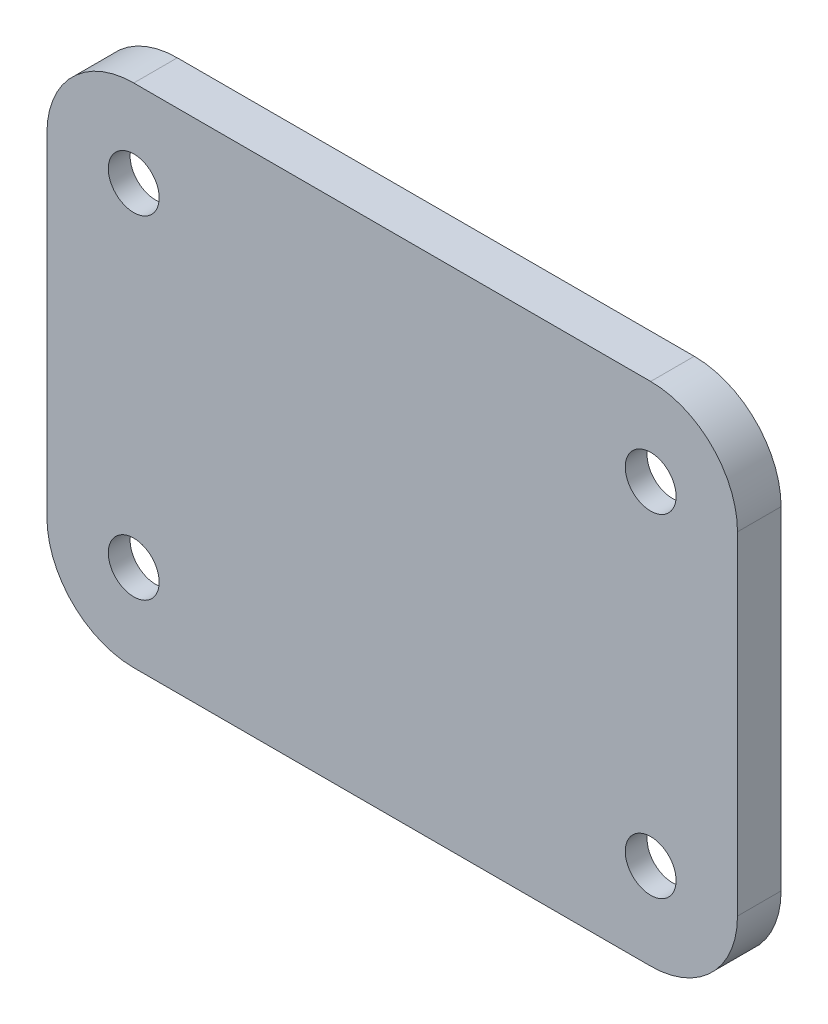
ISO-10303-21;
HEADER;
FILE_DESCRIPTION(('STEP AP214'),'2;1');
FILE_NAME('part.step','',(''),(''),'','','');
FILE_SCHEMA(('AUTOMOTIVE_DESIGN { 1 0 10303 214 1 1 1 1 }'));
ENDSEC;
DATA;
#1=APPLICATION_CONTEXT('core data for automotive mechanical design processes');
#2=APPLICATION_PROTOCOL_DEFINITION('international standard','automotive_design',2000,#1);
#3=PRODUCT_CONTEXT('',#1,'mechanical');
#4=PRODUCT('Part','Part','',(#3));
#5=PRODUCT_RELATED_PRODUCT_CATEGORY('part','',(#4));
#6=PRODUCT_DEFINITION_FORMATION('','',#4);
#7=PRODUCT_DEFINITION_CONTEXT('part definition',#1,'design');
#8=PRODUCT_DEFINITION('design','',#6,#7);
#9=PRODUCT_DEFINITION_SHAPE('','',#8);
#10=(LENGTH_UNIT() NAMED_UNIT(*) SI_UNIT(.MILLI.,.METRE.));
#11=(NAMED_UNIT(*) PLANE_ANGLE_UNIT() SI_UNIT($,.RADIAN.));
#12=(NAMED_UNIT(*) SI_UNIT($,.STERADIAN.) SOLID_ANGLE_UNIT());
#13=UNCERTAINTY_MEASURE_WITH_UNIT(LENGTH_MEASURE(1.E-05),#10,'distance_accuracy_value','');
#14=(GEOMETRIC_REPRESENTATION_CONTEXT(3) GLOBAL_UNCERTAINTY_ASSIGNED_CONTEXT((#13)) GLOBAL_UNIT_ASSIGNED_CONTEXT((#10,
#11,#12)) REPRESENTATION_CONTEXT('',''));
#15=CARTESIAN_POINT('',(0.,0.,0.));
#16=DIRECTION('',(0.,0.,1.));
#17=DIRECTION('',(1.,0.,0.));
#18=AXIS2_PLACEMENT_3D('',#15,#16,#17);
#19=CARTESIAN_POINT('',(0.,0.,0.));
#20=DIRECTION('',(0.,0.,1.));
#21=DIRECTION('',(1.,0.,0.));
#22=AXIS2_PLACEMENT_3D('',#19,#20,#21);
#23=PLANE('',#22);
#24=CARTESIAN_POINT('',(-17.7875,-11.45,0.));
#25=DIRECTION('',(0.,0.,1.));
#26=DIRECTION('',(1.,0.,0.));
#27=AXIS2_PLACEMENT_3D('',#24,#25,#26);
#28=CIRCLE('',#27,1.75);
#29=CARTESIAN_POINT('',(-16.0375,-11.45,0.));
#30=VERTEX_POINT('',#29);
#31=EDGE_CURVE('E442',#30,#30,#28,.T.);
#32=ORIENTED_EDGE('',*,*,#31,.T.);
#33=EDGE_LOOP('',(#32));
#34=FACE_BOUND('',#33,.T.);
#35=DIRECTION('',(1.,0.,0.));
#36=VECTOR('',#35,1.);
#37=CARTESIAN_POINT('',(0.,-6.97500000000003,0.));
#38=LINE('',#37,#36);
#39=CARTESIAN_POINT('',(-22.2625,-6.97500000000003,0.));
#40=VERTEX_POINT('',#39);
#41=CARTESIAN_POINT('',(-17.7875,-6.97500000000003,0.));
#42=VERTEX_POINT('',#41);
#43=EDGE_CURVE('E50',#40,#42,#38,.T.);
#44=ORIENTED_EDGE('',*,*,#43,.T.);
#45=CARTESIAN_POINT('',(-17.7875,-11.45,0.));
#46=DIRECTION('',(0.,0.,-1.));
#47=DIRECTION('',(-1.,0.,0.));
#48=AXIS2_PLACEMENT_3D('',#45,#46,#47);
#49=CIRCLE('',#48,4.47499999999997);
#50=CARTESIAN_POINT('',(-13.3125,-11.45,0.));
#51=VERTEX_POINT('',#50);
#52=EDGE_CURVE('E308',#42,#51,#49,.T.);
#53=ORIENTED_EDGE('',*,*,#52,.T.);
#54=DIRECTION('',(0.,1.,0.));
#55=VECTOR('',#54,1.);
#56=CARTESIAN_POINT('',(-13.3125,0.,0.));
#57=LINE('',#56,#55);
#58=CARTESIAN_POINT('',(-13.3125,-15.925,0.));
#59=VERTEX_POINT('',#58);
#60=EDGE_CURVE('E305',#59,#51,#57,.T.);
#61=ORIENTED_EDGE('',*,*,#60,.F.);
#62=DIRECTION('',(-1.,0.,0.));
#63=VECTOR('',#62,1.);
#64=CARTESIAN_POINT('',(17.7875,-15.925,0.));
#65=LINE('',#64,#63);
#66=CARTESIAN_POINT('',(-17.7875,-15.925,0.));
#67=VERTEX_POINT('',#66);
#68=EDGE_CURVE('E385',#59,#67,#65,.T.);
#69=ORIENTED_EDGE('',*,*,#68,.T.);
#70=CARTESIAN_POINT('',(-17.7875,-11.45,0.));
#71=DIRECTION('',(0.,0.,-1.));
#72=DIRECTION('',(-1.,0.,0.));
#73=AXIS2_PLACEMENT_3D('',#70,#71,#72);
#74=CIRCLE('',#73,4.47499999999997);
#75=CARTESIAN_POINT('',(-22.2625,-11.45,0.));
#76=VERTEX_POINT('',#75);
#77=EDGE_CURVE('E389',#67,#76,#74,.T.);
#78=ORIENTED_EDGE('',*,*,#77,.T.);
#79=DIRECTION('',(0.,1.,0.));
#80=VECTOR('',#79,1.);
#81=CARTESIAN_POINT('',(-22.2625,-11.45,0.));
#82=LINE('',#81,#80);
#83=EDGE_CURVE('E354',#76,#40,#82,.T.);
#84=ORIENTED_EDGE('',*,*,#83,.T.);
#85=EDGE_LOOP('',(#44,#53,#61,#69,#78,#84));
#86=FACE_BOUND('',#85,.T.);
#87=ADVANCED_FACE('F35',(#34,#86),#23,.F.);
#88=CARTESIAN_POINT('',(17.7875,-11.45,0.));
#89=DIRECTION('',(0.,0.,1.));
#90=DIRECTION('',(1.,0.,0.));
#91=AXIS2_PLACEMENT_3D('',#88,#89,#90);
#92=CIRCLE('',#91,1.75);
#93=CARTESIAN_POINT('',(19.5375,-11.45,0.));
#94=VERTEX_POINT('',#93);
#95=EDGE_CURVE('E475',#94,#94,#92,.T.);
#96=ORIENTED_EDGE('',*,*,#95,.T.);
#97=EDGE_LOOP('',(#96));
#98=FACE_BOUND('',#97,.T.);
#99=DIRECTION('',(0.,1.,0.));
#100=VECTOR('',#99,1.);
#101=CARTESIAN_POINT('',(13.3125,0.,0.));
#102=LINE('',#101,#100);
#103=CARTESIAN_POINT('',(13.3125,-15.925,0.));
#104=VERTEX_POINT('',#103);
#105=CARTESIAN_POINT('',(13.3125,-6.97500000000003,0.));
#106=VERTEX_POINT('',#105);
#107=EDGE_CURVE('E302',#104,#106,#102,.T.);
#108=ORIENTED_EDGE('',*,*,#107,.T.);
#109=DIRECTION('',(1.,0.,0.));
#110=VECTOR('',#109,1.);
#111=CARTESIAN_POINT('',(0.,-6.97500000000003,0.));
#112=LINE('',#111,#110);
#113=CARTESIAN_POINT('',(22.2625,-6.97500000000003,0.));
#114=VERTEX_POINT('',#113);
#115=EDGE_CURVE('E299',#106,#114,#112,.T.);
#116=ORIENTED_EDGE('',*,*,#115,.T.);
#117=DIRECTION('',(0.,-1.,0.));
#118=VECTOR('',#117,1.);
#119=CARTESIAN_POINT('',(22.2625,11.45,0.));
#120=LINE('',#119,#118);
#121=CARTESIAN_POINT('',(22.2625,-11.45,0.));
#122=VERTEX_POINT('',#121);
#123=EDGE_CURVE('E378',#114,#122,#120,.T.);
#124=ORIENTED_EDGE('',*,*,#123,.T.);
#125=CARTESIAN_POINT('',(17.7875,-11.45,0.));
#126=DIRECTION('',(0.,0.,-1.));
#127=DIRECTION('',(-1.,0.,0.));
#128=AXIS2_PLACEMENT_3D('',#125,#126,#127);
#129=CIRCLE('',#128,4.47499999999998);
#130=CARTESIAN_POINT('',(17.7875,-15.925,0.));
#131=VERTEX_POINT('',#130);
#132=EDGE_CURVE('E382',#122,#131,#129,.T.);
#133=ORIENTED_EDGE('',*,*,#132,.T.);
#134=EDGE_CURVE('E386',#131,#104,#65,.T.);
#135=ORIENTED_EDGE('',*,*,#134,.T.);
#136=EDGE_LOOP('',(#108,#116,#124,#133,#135));
#137=FACE_BOUND('',#136,.T.);
#138=ADVANCED_FACE('F552',(#98,#137),#23,.F.);
#139=CARTESIAN_POINT('',(17.7875,11.45,0.));
#140=DIRECTION('',(0.,0.,1.));
#141=DIRECTION('',(1.,0.,0.));
#142=AXIS2_PLACEMENT_3D('',#139,#140,#141);
#143=CIRCLE('',#142,1.75);
#144=CARTESIAN_POINT('',(19.5375,11.45,0.));
#145=VERTEX_POINT('',#144);
#146=EDGE_CURVE('E472',#145,#145,#143,.T.);
#147=ORIENTED_EDGE('',*,*,#146,.T.);
#148=EDGE_LOOP('',(#147));
#149=FACE_BOUND('',#148,.T.);
#150=DIRECTION('',(0.,1.,0.));
#151=VECTOR('',#150,1.);
#152=CARTESIAN_POINT('',(13.3125,0.,0.));
#153=LINE('',#152,#151);
#154=CARTESIAN_POINT('',(13.3125,11.45,0.));
#155=VERTEX_POINT('',#154);
#156=CARTESIAN_POINT('',(13.3125,15.925,0.));
#157=VERTEX_POINT('',#156);
#158=EDGE_CURVE('E260',#155,#157,#153,.T.);
#159=ORIENTED_EDGE('',*,*,#158,.T.);
#160=DIRECTION('',(1.,0.,0.));
#161=VECTOR('',#160,1.);
#162=CARTESIAN_POINT('',(-17.7875,15.925,0.));
#163=LINE('',#162,#161);
#164=CARTESIAN_POINT('',(17.7875,15.925,0.));
#165=VERTEX_POINT('',#164);
#166=EDGE_CURVE('E371',#157,#165,#163,.T.);
#167=ORIENTED_EDGE('',*,*,#166,.T.);
#168=CARTESIAN_POINT('',(17.7875,11.45,0.));
#169=DIRECTION('',(0.,0.,-1.));
#170=DIRECTION('',(-1.,0.,0.));
#171=AXIS2_PLACEMENT_3D('',#168,#169,#170);
#172=CIRCLE('',#171,4.47499999999998);
#173=CARTESIAN_POINT('',(22.2625,11.45,0.));
#174=VERTEX_POINT('',#173);
#175=EDGE_CURVE('E375',#165,#174,#172,.T.);
#176=ORIENTED_EDGE('',*,*,#175,.T.);
#177=CARTESIAN_POINT('',(22.2625,6.97500000000003,0.));
#178=VERTEX_POINT('',#177);
#179=EDGE_CURVE('E379',#174,#178,#120,.T.);
#180=ORIENTED_EDGE('',*,*,#179,.T.);
#181=DIRECTION('',(1.,0.,0.));
#182=VECTOR('',#181,1.);
#183=CARTESIAN_POINT('',(0.,6.97500000000003,0.));
#184=LINE('',#183,#182);
#185=CARTESIAN_POINT('',(17.7875,6.97500000000003,0.));
#186=VERTEX_POINT('',#185);
#187=EDGE_CURVE('E297',#186,#178,#184,.T.);
#188=ORIENTED_EDGE('',*,*,#187,.F.);
#189=CARTESIAN_POINT('',(17.7875,11.45,0.));
#190=DIRECTION('',(0.,0.,-1.));
#191=DIRECTION('',(-1.,0.,0.));
#192=AXIS2_PLACEMENT_3D('',#189,#190,#191);
#193=CIRCLE('',#192,4.47499999999998);
#194=EDGE_CURVE('E246',#186,#155,#193,.T.);
#195=ORIENTED_EDGE('',*,*,#194,.T.);
#196=EDGE_LOOP('',(#159,#167,#176,#180,#188,#195));
#197=FACE_BOUND('',#196,.T.);
#198=ADVANCED_FACE('F658',(#149,#197),#23,.F.);
#199=CARTESIAN_POINT('',(0.,-17.425,1.5));
#200=DIRECTION('',(0.,-1.,0.));
#201=DIRECTION('',(0.,0.,-1.));
#202=AXIS2_PLACEMENT_3D('',#199,#200,#201);
#203=PLANE('',#202);
#204=DIRECTION('',(0.,0.,-1.));
#205=VECTOR('',#204,1.);
#206=CARTESIAN_POINT('',(-17.7875,-17.425,1.5));
#207=LINE('',#206,#205);
#208=CARTESIAN_POINT('',(-17.7875,-17.425,1.5));
#209=VERTEX_POINT('',#208);
#210=CARTESIAN_POINT('',(-17.7875,-17.425,-1.5));
#211=VERTEX_POINT('',#210);
#212=EDGE_CURVE('E469',#209,#211,#207,.T.);
#213=ORIENTED_EDGE('',*,*,#212,.T.);
#214=DIRECTION('',(-1.,0.,0.));
#215=VECTOR('',#214,1.);
#216=CARTESIAN_POINT('',(17.7875,-17.425,-1.5));
#217=LINE('',#216,#215);
#218=CARTESIAN_POINT('',(17.7875,-17.425,-1.5));
#219=VERTEX_POINT('',#218);
#220=EDGE_CURVE('E434',#219,#211,#217,.T.);
#221=ORIENTED_EDGE('',*,*,#220,.F.);
#222=DIRECTION('',(0.,0.,-1.));
#223=VECTOR('',#222,1.);
#224=CARTESIAN_POINT('',(17.7875,-17.425,1.5));
#225=LINE('',#224,#223);
#226=CARTESIAN_POINT('',(17.7875,-17.425,1.5));
#227=VERTEX_POINT('',#226);
#228=EDGE_CURVE('E11',#227,#219,#225,.T.);
#229=ORIENTED_EDGE('',*,*,#228,.F.);
#230=DIRECTION('',(-1.,0.,0.));
#231=VECTOR('',#230,1.);
#232=CARTESIAN_POINT('',(0.,-17.425,1.5));
#233=LINE('',#232,#231);
#234=EDGE_CURVE('E438',#227,#209,#233,.T.);
#235=ORIENTED_EDGE('',*,*,#234,.T.);
#236=EDGE_LOOP('',(#213,#221,#229,#235));
#237=FACE_BOUND('',#236,.T.);
#238=ADVANCED_FACE('F37',(#237),#203,.T.);
#239=CARTESIAN_POINT('',(17.7875,-11.45,1.5));
#240=DIRECTION('',(0.,0.,-1.));
#241=DIRECTION('',(-1.,0.,0.));
#242=AXIS2_PLACEMENT_3D('',#239,#240,#241);
#243=CYLINDRICAL_SURFACE('',#242,5.97499999999997);
#244=ORIENTED_EDGE('',*,*,#228,.T.);
#245=CARTESIAN_POINT('',(17.7875,-11.45,-1.5));
#246=DIRECTION('',(0.,0.,-1.));
#247=DIRECTION('',(-1.,0.,0.));
#248=AXIS2_PLACEMENT_3D('',#245,#246,#247);
#249=CIRCLE('',#248,5.97499999999997);
#250=CARTESIAN_POINT('',(23.7625,-11.45,-1.5));
#251=VERTEX_POINT('',#250);
#252=EDGE_CURVE('E431',#251,#219,#249,.T.);
#253=ORIENTED_EDGE('',*,*,#252,.F.);
#254=DIRECTION('',(0.,0.,-1.));
#255=VECTOR('',#254,1.);
#256=CARTESIAN_POINT('',(23.7625,-11.45,1.5));
#257=LINE('',#256,#255);
#258=CARTESIAN_POINT('',(23.7625,-11.45,1.5));
#259=VERTEX_POINT('',#258);
#260=EDGE_CURVE('E43',#259,#251,#257,.T.);
#261=ORIENTED_EDGE('',*,*,#260,.F.);
#262=CARTESIAN_POINT('',(17.7875,-11.45,1.5));
#263=DIRECTION('',(0.,0.,1.));
#264=DIRECTION('',(1.,0.,0.));
#265=AXIS2_PLACEMENT_3D('',#262,#263,#264);
#266=CIRCLE('',#265,5.97499999999997);
#267=EDGE_CURVE('E441',#227,#259,#266,.T.);
#268=ORIENTED_EDGE('',*,*,#267,.F.);
#269=EDGE_LOOP('',(#244,#253,#261,#268));
#270=FACE_BOUND('',#269,.T.);
#271=ADVANCED_FACE('F504',(#270),#243,.T.);
#272=CARTESIAN_POINT('',(23.7625,0.,1.5));
#273=DIRECTION('',(-1.,0.,0.));
#274=DIRECTION('',(0.,0.,1.));
#275=AXIS2_PLACEMENT_3D('',#272,#273,#274);
#276=PLANE('',#275);
#277=ORIENTED_EDGE('',*,*,#260,.T.);
#278=DIRECTION('',(0.,-1.,0.));
#279=VECTOR('',#278,1.);
#280=CARTESIAN_POINT('',(23.7625,11.45,-1.5));
#281=LINE('',#280,#279);
#282=CARTESIAN_POINT('',(23.7625,11.45,-1.5));
#283=VERTEX_POINT('',#282);
#284=EDGE_CURVE('E428',#283,#251,#281,.T.);
#285=ORIENTED_EDGE('',*,*,#284,.F.);
#286=DIRECTION('',(0.,0.,-1.));
#287=VECTOR('',#286,1.);
#288=CARTESIAN_POINT('',(23.7625,11.45,1.5));
#289=LINE('',#288,#287);
#290=CARTESIAN_POINT('',(23.7625,11.45,1.5));
#291=VERTEX_POINT('',#290);
#292=EDGE_CURVE('E489',#291,#283,#289,.T.);
#293=ORIENTED_EDGE('',*,*,#292,.F.);
#294=DIRECTION('',(0.,1.,0.));
#295=VECTOR('',#294,1.);
#296=CARTESIAN_POINT('',(23.7625,0.,1.5));
#297=LINE('',#296,#295);
#298=EDGE_CURVE('E444',#259,#291,#297,.T.);
#299=ORIENTED_EDGE('',*,*,#298,.F.);
#300=EDGE_LOOP('',(#277,#285,#293,#299));
#301=FACE_BOUND('',#300,.T.);
#302=ADVANCED_FACE('F494',(#301),#276,.F.);
#303=CARTESIAN_POINT('',(17.7875,11.45,1.5));
#304=DIRECTION('',(0.,0.,-1.));
#305=DIRECTION('',(-1.,0.,0.));
#306=AXIS2_PLACEMENT_3D('',#303,#304,#305);
#307=CYLINDRICAL_SURFACE('',#306,5.97499999999997);
#308=ORIENTED_EDGE('',*,*,#292,.T.);
#309=CARTESIAN_POINT('',(17.7875,11.45,-1.5));
#310=DIRECTION('',(0.,0.,-1.));
#311=DIRECTION('',(-1.,0.,0.));
#312=AXIS2_PLACEMENT_3D('',#309,#310,#311);
#313=CIRCLE('',#312,5.97499999999998);
#314=CARTESIAN_POINT('',(17.7875,17.425,-1.5));
#315=VERTEX_POINT('',#314);
#316=EDGE_CURVE('E425',#315,#283,#313,.T.);
#317=ORIENTED_EDGE('',*,*,#316,.F.);
#318=DIRECTION('',(0.,0.,-1.));
#319=VECTOR('',#318,1.);
#320=CARTESIAN_POINT('',(17.7875,17.425,1.5));
#321=LINE('',#320,#319);
#322=CARTESIAN_POINT('',(17.7875,17.425,1.5));
#323=VERTEX_POINT('',#322);
#324=EDGE_CURVE('E487',#323,#315,#321,.T.);
#325=ORIENTED_EDGE('',*,*,#324,.F.);
#326=CARTESIAN_POINT('',(17.7875,11.45,1.5));
#327=DIRECTION('',(0.,0.,1.));
#328=DIRECTION('',(1.,0.,0.));
#329=AXIS2_PLACEMENT_3D('',#326,#327,#328);
#330=CIRCLE('',#329,5.97499999999997);
#331=EDGE_CURVE('E446',#291,#323,#330,.T.);
#332=ORIENTED_EDGE('',*,*,#331,.F.);
#333=EDGE_LOOP('',(#308,#317,#325,#332));
#334=FACE_BOUND('',#333,.T.);
#335=ADVANCED_FACE('F528',(#334),#307,.T.);
#336=CARTESIAN_POINT('',(0.,17.425,1.5));
#337=DIRECTION('',(0.,-1.,0.));
#338=DIRECTION('',(0.,0.,-1.));
#339=AXIS2_PLACEMENT_3D('',#336,#337,#338);
#340=PLANE('',#339);
#341=ORIENTED_EDGE('',*,*,#324,.T.);
#342=DIRECTION('',(1.,0.,0.));
#343=VECTOR('',#342,1.);
#344=CARTESIAN_POINT('',(-17.7875,17.425,-1.5));
#345=LINE('',#344,#343);
#346=CARTESIAN_POINT('',(-17.7875,17.425,-1.5));
#347=VERTEX_POINT('',#346);
#348=EDGE_CURVE('E422',#347,#315,#345,.T.);
#349=ORIENTED_EDGE('',*,*,#348,.F.);
#350=DIRECTION('',(0.,0.,-1.));
#351=VECTOR('',#350,1.);
#352=CARTESIAN_POINT('',(-17.7875,17.425,1.5));
#353=LINE('',#352,#351);
#354=CARTESIAN_POINT('',(-17.7875,17.425,1.5));
#355=VERTEX_POINT('',#354);
#356=EDGE_CURVE('E485',#355,#347,#353,.T.);
#357=ORIENTED_EDGE('',*,*,#356,.F.);
#358=DIRECTION('',(-1.,0.,0.));
#359=VECTOR('',#358,1.);
#360=CARTESIAN_POINT('',(0.,17.425,1.5));
#361=LINE('',#360,#359);
#362=EDGE_CURVE('E448',#323,#355,#361,.T.);
#363=ORIENTED_EDGE('',*,*,#362,.F.);
#364=EDGE_LOOP('',(#341,#349,#357,#363));
#365=FACE_BOUND('',#364,.T.);
#366=ADVANCED_FACE('F525',(#365),#340,.F.);
#367=CARTESIAN_POINT('',(-17.7875,11.45,1.5));
#368=DIRECTION('',(0.,0.,-1.));
#369=DIRECTION('',(-1.,0.,0.));
#370=AXIS2_PLACEMENT_3D('',#367,#368,#369);
#371=CYLINDRICAL_SURFACE('',#370,5.97499999999997);
#372=ORIENTED_EDGE('',*,*,#356,.T.);
#373=CARTESIAN_POINT('',(-17.7875,11.45,-1.5));
#374=DIRECTION('',(0.,0.,-1.));
#375=DIRECTION('',(-1.,0.,0.));
#376=AXIS2_PLACEMENT_3D('',#373,#374,#375);
#377=CIRCLE('',#376,5.97499999999998);
#378=CARTESIAN_POINT('',(-23.7625,11.45,-1.5));
#379=VERTEX_POINT('',#378);
#380=EDGE_CURVE('E419',#379,#347,#377,.T.);
#381=ORIENTED_EDGE('',*,*,#380,.F.);
#382=DIRECTION('',(0.,0.,-1.));
#383=VECTOR('',#382,1.);
#384=CARTESIAN_POINT('',(-23.7625,11.45,1.5));
#385=LINE('',#384,#383);
#386=CARTESIAN_POINT('',(-23.7625,11.45,1.5));
#387=VERTEX_POINT('',#386);
#388=EDGE_CURVE('E483',#387,#379,#385,.T.);
#389=ORIENTED_EDGE('',*,*,#388,.F.);
#390=CARTESIAN_POINT('',(-17.7875,11.45,1.5));
#391=DIRECTION('',(0.,0.,1.));
#392=DIRECTION('',(1.,0.,0.));
#393=AXIS2_PLACEMENT_3D('',#390,#391,#392);
#394=CIRCLE('',#393,5.97499999999997);
#395=EDGE_CURVE('E450',#355,#387,#394,.T.);
#396=ORIENTED_EDGE('',*,*,#395,.F.);
#397=EDGE_LOOP('',(#372,#381,#389,#396));
#398=FACE_BOUND('',#397,.T.);
#399=ADVANCED_FACE('F520',(#398),#371,.T.);
#400=CARTESIAN_POINT('',(-23.7625,0.,1.5));
#401=DIRECTION('',(-1.,0.,0.));
#402=DIRECTION('',(0.,0.,1.));
#403=AXIS2_PLACEMENT_3D('',#400,#401,#402);
#404=PLANE('',#403);
#405=ORIENTED_EDGE('',*,*,#388,.T.);
#406=DIRECTION('',(0.,1.,0.));
#407=VECTOR('',#406,1.);
#408=CARTESIAN_POINT('',(-23.7625,-11.45,-1.5));
#409=LINE('',#408,#407);
#410=CARTESIAN_POINT('',(-23.7625,-11.45,-1.5));
#411=VERTEX_POINT('',#410);
#412=EDGE_CURVE('E416',#411,#379,#409,.T.);
#413=ORIENTED_EDGE('',*,*,#412,.F.);
#414=DIRECTION('',(0.,0.,-1.));
#415=VECTOR('',#414,1.);
#416=CARTESIAN_POINT('',(-23.7625,-11.45,1.5));
#417=LINE('',#416,#415);
#418=CARTESIAN_POINT('',(-23.7625,-11.45,1.5));
#419=VERTEX_POINT('',#418);
#420=EDGE_CURVE('E481',#419,#411,#417,.T.);
#421=ORIENTED_EDGE('',*,*,#420,.F.);
#422=DIRECTION('',(0.,1.,0.));
#423=VECTOR('',#422,1.);
#424=CARTESIAN_POINT('',(-23.7625,0.,1.5));
#425=LINE('',#424,#423);
#426=EDGE_CURVE('E452',#419,#387,#425,.T.);
#427=ORIENTED_EDGE('',*,*,#426,.T.);
#428=EDGE_LOOP('',(#405,#413,#421,#427));
#429=FACE_BOUND('',#428,.T.);
#430=ADVANCED_FACE('F515',(#429),#404,.T.);
#431=CARTESIAN_POINT('',(17.7875,-11.45,1.5));
#432=DIRECTION('',(0.,0.,-1.));
#433=DIRECTION('',(-1.,0.,0.));
#434=AXIS2_PLACEMENT_3D('',#431,#432,#433);
#435=CYLINDRICAL_SURFACE('',#434,1.75);
#436=CARTESIAN_POINT('',(17.7875,-11.45,1.5));
#437=DIRECTION('',(0.,0.,1.));
#438=DIRECTION('',(1.,0.,0.));
#439=AXIS2_PLACEMENT_3D('',#436,#437,#438);
#440=CIRCLE('',#439,1.75);
#441=CARTESIAN_POINT('',(19.5375,-11.45,1.5));
#442=VERTEX_POINT('',#441);
#443=EDGE_CURVE('E463',#442,#442,#440,.T.);
#444=ORIENTED_EDGE('',*,*,#443,.T.);
#445=EDGE_LOOP('',(#444));
#446=FACE_BOUND('',#445,.T.);
#447=ORIENTED_EDGE('',*,*,#95,.F.);
#448=EDGE_LOOP('',(#447));
#449=FACE_BOUND('',#448,.T.);
#450=ADVANCED_FACE('F660',(#446,#449),#435,.F.);
#451=CARTESIAN_POINT('',(17.7875,11.45,1.5));
#452=DIRECTION('',(0.,0.,-1.));
#453=DIRECTION('',(-1.,0.,0.));
#454=AXIS2_PLACEMENT_3D('',#451,#452,#453);
#455=CYLINDRICAL_SURFACE('',#454,1.75);
#456=CARTESIAN_POINT('',(17.7875,11.45,1.5));
#457=DIRECTION('',(0.,0.,1.));
#458=DIRECTION('',(1.,0.,0.));
#459=AXIS2_PLACEMENT_3D('',#456,#457,#458);
#460=CIRCLE('',#459,1.75);
#461=CARTESIAN_POINT('',(19.5375,11.45,1.5));
#462=VERTEX_POINT('',#461);
#463=EDGE_CURVE('E460',#462,#462,#460,.T.);
#464=ORIENTED_EDGE('',*,*,#463,.T.);
#465=EDGE_LOOP('',(#464));
#466=FACE_BOUND('',#465,.T.);
#467=ORIENTED_EDGE('',*,*,#146,.F.);
#468=EDGE_LOOP('',(#467));
#469=FACE_BOUND('',#468,.T.);
#470=ADVANCED_FACE('F663',(#466,#469),#455,.F.);
#471=CARTESIAN_POINT('',(-17.7875,11.45,1.5));
#472=DIRECTION('',(0.,0.,-1.));
#473=DIRECTION('',(-1.,0.,0.));
#474=AXIS2_PLACEMENT_3D('',#471,#472,#473);
#475=CYLINDRICAL_SURFACE('',#474,1.75);
#476=CARTESIAN_POINT('',(-17.7875,11.45,1.5));
#477=DIRECTION('',(0.,0.,1.));
#478=DIRECTION('',(1.,0.,0.));
#479=AXIS2_PLACEMENT_3D('',#476,#477,#478);
#480=CIRCLE('',#479,1.75);
#481=CARTESIAN_POINT('',(-16.0375,11.45,1.5));
#482=VERTEX_POINT('',#481);
#483=EDGE_CURVE('E457',#482,#482,#480,.T.);
#484=ORIENTED_EDGE('',*,*,#483,.T.);
#485=EDGE_LOOP('',(#484));
#486=FACE_BOUND('',#485,.T.);
#487=CARTESIAN_POINT('',(-17.7875,11.45,0.));
#488=DIRECTION('',(0.,0.,1.));
#489=DIRECTION('',(1.,0.,0.));
#490=AXIS2_PLACEMENT_3D('',#487,#488,#489);
#491=CIRCLE('',#490,1.75);
#492=CARTESIAN_POINT('',(-16.0375,11.45,0.));
#493=VERTEX_POINT('',#492);
#494=EDGE_CURVE('E437',#493,#493,#491,.T.);
#495=ORIENTED_EDGE('',*,*,#494,.F.);
#496=EDGE_LOOP('',(#495));
#497=FACE_BOUND('',#496,.T.);
#498=ADVANCED_FACE('F667',(#486,#497),#475,.F.);
#499=CARTESIAN_POINT('',(-17.7875,-11.45,1.5));
#500=DIRECTION('',(0.,0.,-1.));
#501=DIRECTION('',(-1.,0.,0.));
#502=AXIS2_PLACEMENT_3D('',#499,#500,#501);
#503=CYLINDRICAL_SURFACE('',#502,5.97499999999997);
#504=ORIENTED_EDGE('',*,*,#420,.T.);
#505=CARTESIAN_POINT('',(-17.7875,-11.45,-1.5));
#506=DIRECTION('',(0.,0.,-1.));
#507=DIRECTION('',(-1.,0.,0.));
#508=AXIS2_PLACEMENT_3D('',#505,#506,#507);
#509=CIRCLE('',#508,5.97499999999997);
#510=EDGE_CURVE('E413',#211,#411,#509,.T.);
#511=ORIENTED_EDGE('',*,*,#510,.F.);
#512=ORIENTED_EDGE('',*,*,#212,.F.);
#513=CARTESIAN_POINT('',(-17.7875,-11.45,1.5));
#514=DIRECTION('',(0.,0.,1.));
#515=DIRECTION('',(1.,0.,0.));
#516=AXIS2_PLACEMENT_3D('',#513,#514,#515);
#517=CIRCLE('',#516,5.97499999999997);
#518=EDGE_CURVE('E455',#419,#209,#517,.T.);
#519=ORIENTED_EDGE('',*,*,#518,.F.);
#520=EDGE_LOOP('',(#504,#511,#512,#519));
#521=FACE_BOUND('',#520,.T.);
#522=ADVANCED_FACE('F510',(#521),#503,.T.);
#523=CARTESIAN_POINT('',(-17.7875,-11.45,1.5));
#524=DIRECTION('',(0.,0.,-1.));
#525=DIRECTION('',(-1.,0.,0.));
#526=AXIS2_PLACEMENT_3D('',#523,#524,#525);
#527=CYLINDRICAL_SURFACE('',#526,1.75);
#528=CARTESIAN_POINT('',(-17.7875,-11.45,1.5));
#529=DIRECTION('',(0.,0.,1.));
#530=DIRECTION('',(1.,0.,0.));
#531=AXIS2_PLACEMENT_3D('',#528,#529,#530);
#532=CIRCLE('',#531,1.75);
#533=CARTESIAN_POINT('',(-16.0375,-11.45,1.5));
#534=VERTEX_POINT('',#533);
#535=EDGE_CURVE('E466',#534,#534,#532,.T.);
#536=ORIENTED_EDGE('',*,*,#535,.T.);
#537=EDGE_LOOP('',(#536));
#538=FACE_BOUND('',#537,.T.);
#539=ORIENTED_EDGE('',*,*,#31,.F.);
#540=EDGE_LOOP('',(#539));
#541=FACE_BOUND('',#540,.T.);
#542=ADVANCED_FACE('F535',(#538,#541),#527,.F.);
#543=CARTESIAN_POINT('',(0.,0.,1.5));
#544=DIRECTION('',(0.,0.,1.));
#545=DIRECTION('',(1.,0.,0.));
#546=AXIS2_PLACEMENT_3D('',#543,#544,#545);
#547=PLANE('',#546);
#548=ORIENTED_EDGE('',*,*,#234,.F.);
#549=ORIENTED_EDGE('',*,*,#267,.T.);
#550=ORIENTED_EDGE('',*,*,#298,.T.);
#551=ORIENTED_EDGE('',*,*,#331,.T.);
#552=ORIENTED_EDGE('',*,*,#362,.T.);
#553=ORIENTED_EDGE('',*,*,#395,.T.);
#554=ORIENTED_EDGE('',*,*,#426,.F.);
#555=ORIENTED_EDGE('',*,*,#518,.T.);
#556=EDGE_LOOP('',(#548,#549,#550,#551,#552,#553,#554,#555));
#557=FACE_BOUND('',#556,.T.);
#558=ORIENTED_EDGE('',*,*,#483,.F.);
#559=EDGE_LOOP('',(#558));
#560=FACE_BOUND('',#559,.T.);
#561=ORIENTED_EDGE('',*,*,#463,.F.);
#562=EDGE_LOOP('',(#561));
#563=FACE_BOUND('',#562,.T.);
#564=ORIENTED_EDGE('',*,*,#443,.F.);
#565=EDGE_LOOP('',(#564));
#566=FACE_BOUND('',#565,.T.);
#567=ORIENTED_EDGE('',*,*,#535,.F.);
#568=EDGE_LOOP('',(#567));
#569=FACE_BOUND('',#568,.T.);
#570=ADVANCED_FACE('F531',(#557,#560,#563,#566,#569),#547,.T.);
#571=CARTESIAN_POINT('',(-17.7875,15.925,0.));
#572=VERTEX_POINT('',#571);
#573=CARTESIAN_POINT('',(-13.3125,15.925,0.));
#574=VERTEX_POINT('',#573);
#575=EDGE_CURVE('E372',#572,#574,#163,.T.);
#576=ORIENTED_EDGE('',*,*,#575,.T.);
#577=DIRECTION('',(0.,1.,0.));
#578=VECTOR('',#577,1.);
#579=CARTESIAN_POINT('',(-13.3125,0.,0.));
#580=LINE('',#579,#578);
#581=CARTESIAN_POINT('',(-13.3125,11.45,0.));
#582=VERTEX_POINT('',#581);
#583=EDGE_CURVE('E318',#582,#574,#580,.T.);
#584=ORIENTED_EDGE('',*,*,#583,.F.);
#585=CARTESIAN_POINT('',(-17.7875,11.45,0.));
#586=DIRECTION('',(0.,0.,-1.));
#587=DIRECTION('',(-1.,0.,0.));
#588=AXIS2_PLACEMENT_3D('',#585,#586,#587);
#589=CIRCLE('',#588,4.47499999999997);
#590=CARTESIAN_POINT('',(-17.7875,6.97500000000003,0.));
#591=VERTEX_POINT('',#590);
#592=EDGE_CURVE('E315',#582,#591,#589,.T.);
#593=ORIENTED_EDGE('',*,*,#592,.T.);
#594=DIRECTION('',(1.,0.,0.));
#595=VECTOR('',#594,1.);
#596=CARTESIAN_POINT('',(0.,6.97500000000003,0.));
#597=LINE('',#596,#595);
#598=CARTESIAN_POINT('',(-22.2625,6.97500000000003,0.));
#599=VERTEX_POINT('',#598);
#600=EDGE_CURVE('E312',#599,#591,#597,.T.);
#601=ORIENTED_EDGE('',*,*,#600,.F.);
#602=CARTESIAN_POINT('',(-22.2625,11.45,0.));
#603=VERTEX_POINT('',#602);
#604=EDGE_CURVE('E58',#599,#603,#82,.T.);
#605=ORIENTED_EDGE('',*,*,#604,.T.);
#606=CARTESIAN_POINT('',(-17.7875,11.45,0.));
#607=DIRECTION('',(0.,0.,-1.));
#608=DIRECTION('',(-1.,0.,0.));
#609=AXIS2_PLACEMENT_3D('',#606,#607,#608);
#610=CIRCLE('',#609,4.47499999999998);
#611=EDGE_CURVE('E325',#603,#572,#610,.T.);
#612=ORIENTED_EDGE('',*,*,#611,.T.);
#613=EDGE_LOOP('',(#576,#584,#593,#601,#605,#612));
#614=FACE_BOUND('',#613,.T.);
#615=ORIENTED_EDGE('',*,*,#494,.T.);
#616=EDGE_LOOP('',(#615));
#617=FACE_BOUND('',#616,.T.);
#618=ADVANCED_FACE('F534',(#614,#617),#23,.F.);
#619=CARTESIAN_POINT('',(-17.7875,-11.45,-1.5));
#620=DIRECTION('',(0.,0.,-1.));
#621=DIRECTION('',(-1.,0.,0.));
#622=AXIS2_PLACEMENT_3D('',#619,#620,#621);
#623=PLANE('',#622);
#624=ORIENTED_EDGE('',*,*,#510,.T.);
#625=ORIENTED_EDGE('',*,*,#412,.T.);
#626=ORIENTED_EDGE('',*,*,#380,.T.);
#627=ORIENTED_EDGE('',*,*,#348,.T.);
#628=ORIENTED_EDGE('',*,*,#316,.T.);
#629=ORIENTED_EDGE('',*,*,#284,.T.);
#630=ORIENTED_EDGE('',*,*,#252,.T.);
#631=ORIENTED_EDGE('',*,*,#220,.T.);
#632=EDGE_LOOP('',(#624,#625,#626,#627,#628,#629,#630,#631));
#633=FACE_BOUND('',#632,.T.);
#634=DIRECTION('',(1.,0.,0.));
#635=VECTOR('',#634,1.);
#636=CARTESIAN_POINT('',(-17.7875,15.925,-1.5));
#637=LINE('',#636,#635);
#638=CARTESIAN_POINT('',(-17.7875,15.925,-1.5));
#639=VERTEX_POINT('',#638);
#640=CARTESIAN_POINT('',(17.7875,15.925,-1.5));
#641=VERTEX_POINT('',#640);
#642=EDGE_CURVE('E353',#639,#641,#637,.T.);
#643=ORIENTED_EDGE('',*,*,#642,.F.);
#644=CARTESIAN_POINT('',(-17.7875,11.45,-1.5));
#645=DIRECTION('',(0.,0.,-1.));
#646=DIRECTION('',(-1.,0.,0.));
#647=AXIS2_PLACEMENT_3D('',#644,#645,#646);
#648=CIRCLE('',#647,4.47499999999998);
#649=CARTESIAN_POINT('',(-22.2625,11.45,-1.5));
#650=VERTEX_POINT('',#649);
#651=EDGE_CURVE('E351',#650,#639,#648,.T.);
#652=ORIENTED_EDGE('',*,*,#651,.F.);
#653=DIRECTION('',(0.,1.,0.));
#654=VECTOR('',#653,1.);
#655=CARTESIAN_POINT('',(-22.2625,-11.45,-1.5));
#656=LINE('',#655,#654);
#657=CARTESIAN_POINT('',(-22.2625,-11.45,-1.5));
#658=VERTEX_POINT('',#657);
#659=EDGE_CURVE('E367',#658,#650,#656,.T.);
#660=ORIENTED_EDGE('',*,*,#659,.F.);
#661=CARTESIAN_POINT('',(-17.7875,-11.45,-1.5));
#662=DIRECTION('',(0.,0.,-1.));
#663=DIRECTION('',(-1.,0.,0.));
#664=AXIS2_PLACEMENT_3D('',#661,#662,#663);
#665=CIRCLE('',#664,4.47499999999997);
#666=CARTESIAN_POINT('',(-17.7875,-15.925,-1.5));
#667=VERTEX_POINT('',#666);
#668=EDGE_CURVE('E364',#667,#658,#665,.T.);
#669=ORIENTED_EDGE('',*,*,#668,.F.);
#670=DIRECTION('',(-1.,0.,0.));
#671=VECTOR('',#670,1.);
#672=CARTESIAN_POINT('',(17.7875,-15.925,-1.5));
#673=LINE('',#672,#671);
#674=CARTESIAN_POINT('',(17.7875,-15.925,-1.5));
#675=VERTEX_POINT('',#674);
#676=EDGE_CURVE('E362',#675,#667,#673,.T.);
#677=ORIENTED_EDGE('',*,*,#676,.F.);
#678=CARTESIAN_POINT('',(17.7875,-11.45,-1.5));
#679=DIRECTION('',(0.,0.,-1.));
#680=DIRECTION('',(-1.,0.,0.));
#681=AXIS2_PLACEMENT_3D('',#678,#679,#680);
#682=CIRCLE('',#681,4.47499999999998);
#683=CARTESIAN_POINT('',(22.2625,-11.45,-1.5));
#684=VERTEX_POINT('',#683);
#685=EDGE_CURVE('E360',#684,#675,#682,.T.);
#686=ORIENTED_EDGE('',*,*,#685,.F.);
#687=DIRECTION('',(0.,-1.,0.));
#688=VECTOR('',#687,1.);
#689=CARTESIAN_POINT('',(22.2625,11.45,-1.5));
#690=LINE('',#689,#688);
#691=CARTESIAN_POINT('',(22.2625,11.45,-1.5));
#692=VERTEX_POINT('',#691);
#693=EDGE_CURVE('E358',#692,#684,#690,.T.);
#694=ORIENTED_EDGE('',*,*,#693,.F.);
#695=CARTESIAN_POINT('',(17.7875,11.45,-1.5));
#696=DIRECTION('',(0.,0.,-1.));
#697=DIRECTION('',(-1.,0.,0.));
#698=AXIS2_PLACEMENT_3D('',#695,#696,#697);
#699=CIRCLE('',#698,4.47499999999998);
#700=EDGE_CURVE('E356',#641,#692,#699,.T.);
#701=ORIENTED_EDGE('',*,*,#700,.F.);
#702=EDGE_LOOP('',(#643,#652,#660,#669,#677,#686,#694,#701));
#703=FACE_BOUND('',#702,.T.);
#704=ADVANCED_FACE('F500',(#633,#703),#623,.T.);
#705=CARTESIAN_POINT('',(-17.7875,11.45,-1.5));
#706=DIRECTION('',(0.,0.,1.));
#707=DIRECTION('',(1.,0.,0.));
#708=AXIS2_PLACEMENT_3D('',#705,#706,#707);
#709=CYLINDRICAL_SURFACE('',#708,4.47499999999998);
#710=ORIENTED_EDGE('',*,*,#611,.F.);
#711=DIRECTION('',(0.,0.,1.));
#712=VECTOR('',#711,1.);
#713=CARTESIAN_POINT('',(-22.2625,11.45,-1.5));
#714=LINE('',#713,#712);
#715=EDGE_CURVE('E369',#650,#603,#714,.T.);
#716=ORIENTED_EDGE('',*,*,#715,.F.);
#717=ORIENTED_EDGE('',*,*,#651,.T.);
#718=DIRECTION('',(0.,0.,1.));
#719=VECTOR('',#718,1.);
#720=CARTESIAN_POINT('',(-17.7875,15.925,-1.5));
#721=LINE('',#720,#719);
#722=EDGE_CURVE('E410',#639,#572,#721,.T.);
#723=ORIENTED_EDGE('',*,*,#722,.T.);
#724=EDGE_LOOP('',(#710,#716,#717,#723));
#725=FACE_BOUND('',#724,.T.);
#726=ADVANCED_FACE('F588',(#725),#709,.F.);
#727=CARTESIAN_POINT('',(-17.7875,15.925,-1.5));
#728=DIRECTION('',(0.,-1.,0.));
#729=DIRECTION('',(0.,0.,-1.));
#730=AXIS2_PLACEMENT_3D('',#727,#728,#729);
#731=PLANE('',#730);
#732=ORIENTED_EDGE('',*,*,#575,.F.);
#733=ORIENTED_EDGE('',*,*,#722,.F.);
#734=ORIENTED_EDGE('',*,*,#642,.T.);
#735=DIRECTION('',(0.,0.,1.));
#736=VECTOR('',#735,1.);
#737=CARTESIAN_POINT('',(17.7875,15.925,-1.5));
#738=LINE('',#737,#736);
#739=EDGE_CURVE('E407',#641,#165,#738,.T.);
#740=ORIENTED_EDGE('',*,*,#739,.T.);
#741=ORIENTED_EDGE('',*,*,#166,.F.);
#742=DIRECTION('',(0.,0.,-1.));
#743=VECTOR('',#742,1.);
#744=CARTESIAN_POINT('',(13.3125,15.925,0.5));
#745=LINE('',#744,#743);
#746=CARTESIAN_POINT('',(13.3125,15.925,0.5));
#747=VERTEX_POINT('',#746);
#748=EDGE_CURVE('E326',#747,#157,#745,.T.);
#749=ORIENTED_EDGE('',*,*,#748,.F.);
#750=DIRECTION('',(1.,0.,0.));
#751=VECTOR('',#750,1.);
#752=CARTESIAN_POINT('',(0.,15.925,0.5));
#753=LINE('',#752,#751);
#754=CARTESIAN_POINT('',(-13.3125,15.925,0.5));
#755=VERTEX_POINT('',#754);
#756=EDGE_CURVE('E293',#755,#747,#753,.T.);
#757=ORIENTED_EDGE('',*,*,#756,.F.);
#758=DIRECTION('',(0.,0.,-1.));
#759=VECTOR('',#758,1.);
#760=CARTESIAN_POINT('',(-13.3125,15.925,0.5));
#761=LINE('',#760,#759);
#762=EDGE_CURVE('E328',#755,#574,#761,.T.);
#763=ORIENTED_EDGE('',*,*,#762,.T.);
#764=EDGE_LOOP('',(#732,#733,#734,#740,#741,#749,#757,#763));
#765=FACE_BOUND('',#764,.T.);
#766=ADVANCED_FACE('F593',(#765),#731,.T.);
#767=CARTESIAN_POINT('',(17.7875,11.45,-1.5));
#768=DIRECTION('',(0.,0.,1.));
#769=DIRECTION('',(1.,0.,0.));
#770=AXIS2_PLACEMENT_3D('',#767,#768,#769);
#771=CYLINDRICAL_SURFACE('',#770,4.47499999999998);
#772=ORIENTED_EDGE('',*,*,#175,.F.);
#773=ORIENTED_EDGE('',*,*,#739,.F.);
#774=ORIENTED_EDGE('',*,*,#700,.T.);
#775=DIRECTION('',(0.,0.,1.));
#776=VECTOR('',#775,1.);
#777=CARTESIAN_POINT('',(22.2625,11.45,-1.5));
#778=LINE('',#777,#776);
#779=EDGE_CURVE('E405',#692,#174,#778,.T.);
#780=ORIENTED_EDGE('',*,*,#779,.T.);
#781=EDGE_LOOP('',(#772,#773,#774,#780));
#782=FACE_BOUND('',#781,.T.);
#783=ADVANCED_FACE('F647',(#782),#771,.F.);
#784=CARTESIAN_POINT('',(22.2625,11.45,-1.5));
#785=DIRECTION('',(-1.,0.,0.));
#786=DIRECTION('',(0.,0.,1.));
#787=AXIS2_PLACEMENT_3D('',#784,#785,#786);
#788=PLANE('',#787);
#789=ORIENTED_EDGE('',*,*,#179,.F.);
#790=ORIENTED_EDGE('',*,*,#779,.F.);
#791=ORIENTED_EDGE('',*,*,#693,.T.);
#792=DIRECTION('',(0.,0.,1.));
#793=VECTOR('',#792,1.);
#794=CARTESIAN_POINT('',(22.2625,-11.45,-1.5));
#795=LINE('',#794,#793);
#796=EDGE_CURVE('E402',#684,#122,#795,.T.);
#797=ORIENTED_EDGE('',*,*,#796,.T.);
#798=ORIENTED_EDGE('',*,*,#123,.F.);
#799=DIRECTION('',(0.,0.,-1.));
#800=VECTOR('',#799,1.);
#801=CARTESIAN_POINT('',(22.2625,-6.97500000000003,0.5));
#802=LINE('',#801,#800);
#803=CARTESIAN_POINT('',(22.2625,-6.97500000000003,0.5));
#804=VERTEX_POINT('',#803);
#805=EDGE_CURVE('E348',#804,#114,#802,.T.);
#806=ORIENTED_EDGE('',*,*,#805,.F.);
#807=DIRECTION('',(0.,-1.,0.));
#808=VECTOR('',#807,1.);
#809=CARTESIAN_POINT('',(22.2625,0.,0.5));
#810=LINE('',#809,#808);
#811=CARTESIAN_POINT('',(22.2625,6.97500000000003,0.5));
#812=VERTEX_POINT('',#811);
#813=EDGE_CURVE('E264',#812,#804,#810,.T.);
#814=ORIENTED_EDGE('',*,*,#813,.F.);
#815=DIRECTION('',(0.,0.,-1.));
#816=VECTOR('',#815,1.);
#817=CARTESIAN_POINT('',(22.2625,6.97500000000003,0.5));
#818=LINE('',#817,#816);
#819=EDGE_CURVE('E251',#812,#178,#818,.T.);
#820=ORIENTED_EDGE('',*,*,#819,.T.);
#821=EDGE_LOOP('',(#789,#790,#791,#797,#798,#806,#814,#820));
#822=FACE_BOUND('',#821,.T.);
#823=ADVANCED_FACE('F643',(#822),#788,.T.);
#824=CARTESIAN_POINT('',(17.7875,-11.45,-1.5));
#825=DIRECTION('',(0.,0.,1.));
#826=DIRECTION('',(1.,0.,0.));
#827=AXIS2_PLACEMENT_3D('',#824,#825,#826);
#828=CYLINDRICAL_SURFACE('',#827,4.47499999999998);
#829=ORIENTED_EDGE('',*,*,#132,.F.);
#830=ORIENTED_EDGE('',*,*,#796,.F.);
#831=ORIENTED_EDGE('',*,*,#685,.T.);
#832=DIRECTION('',(0.,0.,1.));
#833=VECTOR('',#832,1.);
#834=CARTESIAN_POINT('',(17.7875,-15.925,-1.5));
#835=LINE('',#834,#833);
#836=EDGE_CURVE('E400',#675,#131,#835,.T.);
#837=ORIENTED_EDGE('',*,*,#836,.T.);
#838=EDGE_LOOP('',(#829,#830,#831,#837));
#839=FACE_BOUND('',#838,.T.);
#840=ADVANCED_FACE('F640',(#839),#828,.F.);
#841=CARTESIAN_POINT('',(17.7875,-15.925,-1.5));
#842=DIRECTION('',(0.,1.,0.));
#843=DIRECTION('',(-1.,0.,0.));
#844=AXIS2_PLACEMENT_3D('',#841,#842,#843);
#845=PLANE('',#844);
#846=ORIENTED_EDGE('',*,*,#134,.F.);
#847=ORIENTED_EDGE('',*,*,#836,.F.);
#848=ORIENTED_EDGE('',*,*,#676,.T.);
#849=DIRECTION('',(0.,0.,1.));
#850=VECTOR('',#849,1.);
#851=CARTESIAN_POINT('',(-17.7875,-15.925,-1.5));
#852=LINE('',#851,#850);
#853=EDGE_CURVE('E397',#667,#67,#852,.T.);
#854=ORIENTED_EDGE('',*,*,#853,.T.);
#855=ORIENTED_EDGE('',*,*,#68,.F.);
#856=DIRECTION('',(0.,0.,-1.));
#857=VECTOR('',#856,1.);
#858=CARTESIAN_POINT('',(-13.3125,-15.925,0.5));
#859=LINE('',#858,#857);
#860=CARTESIAN_POINT('',(-13.3125,-15.925,0.5));
#861=VERTEX_POINT('',#860);
#862=EDGE_CURVE('E342',#861,#59,#859,.T.);
#863=ORIENTED_EDGE('',*,*,#862,.F.);
#864=DIRECTION('',(-1.,0.,0.));
#865=VECTOR('',#864,1.);
#866=CARTESIAN_POINT('',(0.,-15.925,0.5));
#867=LINE('',#866,#865);
#868=CARTESIAN_POINT('',(13.3125,-15.925,0.5));
#869=VERTEX_POINT('',#868);
#870=EDGE_CURVE('E272',#869,#861,#867,.T.);
#871=ORIENTED_EDGE('',*,*,#870,.F.);
#872=DIRECTION('',(0.,0.,-1.));
#873=VECTOR('',#872,1.);
#874=CARTESIAN_POINT('',(13.3125,-15.925,0.5));
#875=LINE('',#874,#873);
#876=EDGE_CURVE('E344',#869,#104,#875,.T.);
#877=ORIENTED_EDGE('',*,*,#876,.T.);
#878=EDGE_LOOP('',(#846,#847,#848,#854,#855,#863,#871,#877));
#879=FACE_BOUND('',#878,.T.);
#880=ADVANCED_FACE('F574',(#879),#845,.T.);
#881=CARTESIAN_POINT('',(-17.7875,-11.45,-1.5));
#882=DIRECTION('',(0.,0.,1.));
#883=DIRECTION('',(1.,0.,0.));
#884=AXIS2_PLACEMENT_3D('',#881,#882,#883);
#885=CYLINDRICAL_SURFACE('',#884,4.47499999999997);
#886=ORIENTED_EDGE('',*,*,#77,.F.);
#887=ORIENTED_EDGE('',*,*,#853,.F.);
#888=ORIENTED_EDGE('',*,*,#668,.T.);
#889=DIRECTION('',(0.,0.,1.));
#890=VECTOR('',#889,1.);
#891=CARTESIAN_POINT('',(-22.2625,-11.45,-1.5));
#892=LINE('',#891,#890);
#893=EDGE_CURVE('E395',#658,#76,#892,.T.);
#894=ORIENTED_EDGE('',*,*,#893,.T.);
#895=EDGE_LOOP('',(#886,#887,#888,#894));
#896=FACE_BOUND('',#895,.T.);
#897=ADVANCED_FACE('F581',(#896),#885,.F.);
#898=CARTESIAN_POINT('',(-22.2625,-11.45,-1.5));
#899=DIRECTION('',(1.,0.,0.));
#900=DIRECTION('',(0.,0.,-1.));
#901=AXIS2_PLACEMENT_3D('',#898,#899,#900);
#902=PLANE('',#901);
#903=ORIENTED_EDGE('',*,*,#83,.F.);
#904=ORIENTED_EDGE('',*,*,#893,.F.);
#905=ORIENTED_EDGE('',*,*,#659,.T.);
#906=ORIENTED_EDGE('',*,*,#715,.T.);
#907=ORIENTED_EDGE('',*,*,#604,.F.);
#908=DIRECTION('',(0.,0.,-1.));
#909=VECTOR('',#908,1.);
#910=CARTESIAN_POINT('',(-22.2625,6.97500000000003,0.5));
#911=LINE('',#910,#909);
#912=CARTESIAN_POINT('',(-22.2625,6.97500000000003,0.5));
#913=VERTEX_POINT('',#912);
#914=EDGE_CURVE('E334',#913,#599,#911,.T.);
#915=ORIENTED_EDGE('',*,*,#914,.F.);
#916=DIRECTION('',(0.,1.,0.));
#917=VECTOR('',#916,1.);
#918=CARTESIAN_POINT('',(-22.2625,0.,0.5));
#919=LINE('',#918,#917);
#920=CARTESIAN_POINT('',(-22.2625,-6.97500000000003,0.5));
#921=VERTEX_POINT('',#920);
#922=EDGE_CURVE('E282',#921,#913,#919,.T.);
#923=ORIENTED_EDGE('',*,*,#922,.F.);
#924=DIRECTION('',(0.,0.,-1.));
#925=VECTOR('',#924,1.);
#926=CARTESIAN_POINT('',(-22.2625,-6.97500000000003,0.5));
#927=LINE('',#926,#925);
#928=EDGE_CURVE('E336',#921,#40,#927,.T.);
#929=ORIENTED_EDGE('',*,*,#928,.T.);
#930=EDGE_LOOP('',(#903,#904,#905,#906,#907,#915,#923,#929));
#931=FACE_BOUND('',#930,.T.);
#932=ADVANCED_FACE('F559',(#931),#902,.T.);
#933=CARTESIAN_POINT('',(17.7875,11.45,0.5));
#934=DIRECTION('',(0.,0.,-1.));
#935=DIRECTION('',(-1.,0.,0.));
#936=AXIS2_PLACEMENT_3D('',#933,#934,#935);
#937=CYLINDRICAL_SURFACE('',#936,4.47499999999998);
#938=ORIENTED_EDGE('',*,*,#194,.F.);
#939=DIRECTION('',(0.,0.,-1.));
#940=VECTOR('',#939,1.);
#941=CARTESIAN_POINT('',(17.7875,6.97500000000003,0.5));
#942=LINE('',#941,#940);
#943=CARTESIAN_POINT('',(17.7875,6.97500000000003,0.5));
#944=VERTEX_POINT('',#943);
#945=EDGE_CURVE('E239',#944,#186,#942,.T.);
#946=ORIENTED_EDGE('',*,*,#945,.F.);
#947=CARTESIAN_POINT('',(17.7875,11.45,0.5));
#948=DIRECTION('',(0.,0.,-1.));
#949=DIRECTION('',(-1.,0.,0.));
#950=AXIS2_PLACEMENT_3D('',#947,#948,#949);
#951=CIRCLE('',#950,4.47499999999998);
#952=CARTESIAN_POINT('',(13.3125,11.45,0.5));
#953=VERTEX_POINT('',#952);
#954=EDGE_CURVE('E243',#944,#953,#951,.T.);
#955=ORIENTED_EDGE('',*,*,#954,.T.);
#956=DIRECTION('',(0.,0.,-1.));
#957=VECTOR('',#956,1.);
#958=CARTESIAN_POINT('',(13.3125,11.45,0.5));
#959=LINE('',#958,#957);
#960=EDGE_CURVE('E323',#953,#155,#959,.T.);
#961=ORIENTED_EDGE('',*,*,#960,.T.);
#962=EDGE_LOOP('',(#938,#946,#955,#961));
#963=FACE_BOUND('',#962,.T.);
#964=ADVANCED_FACE('F241',(#963),#937,.T.);
#965=CARTESIAN_POINT('',(13.3125,0.,0.5));
#966=DIRECTION('',(-1.,0.,0.));
#967=DIRECTION('',(0.,0.,1.));
#968=AXIS2_PLACEMENT_3D('',#965,#966,#967);
#969=PLANE('',#968);
#970=ORIENTED_EDGE('',*,*,#158,.F.);
#971=ORIENTED_EDGE('',*,*,#960,.F.);
#972=DIRECTION('',(0.,1.,0.));
#973=VECTOR('',#972,1.);
#974=CARTESIAN_POINT('',(13.3125,0.,0.5));
#975=LINE('',#974,#973);
#976=EDGE_CURVE('E252',#953,#747,#975,.T.);
#977=ORIENTED_EDGE('',*,*,#976,.T.);
#978=ORIENTED_EDGE('',*,*,#748,.T.);
#979=EDGE_LOOP('',(#970,#971,#977,#978));
#980=FACE_BOUND('',#979,.T.);
#981=ADVANCED_FACE('F633',(#980),#969,.T.);
#982=CARTESIAN_POINT('',(-13.3125,0.,0.5));
#983=DIRECTION('',(-1.,0.,0.));
#984=DIRECTION('',(0.,0.,1.));
#985=AXIS2_PLACEMENT_3D('',#982,#983,#984);
#986=PLANE('',#985);
#987=ORIENTED_EDGE('',*,*,#583,.T.);
#988=ORIENTED_EDGE('',*,*,#762,.F.);
#989=DIRECTION('',(0.,1.,0.));
#990=VECTOR('',#989,1.);
#991=CARTESIAN_POINT('',(-13.3125,0.,0.5));
#992=LINE('',#991,#990);
#993=CARTESIAN_POINT('',(-13.3125,11.45,0.5));
#994=VERTEX_POINT('',#993);
#995=EDGE_CURVE('E290',#994,#755,#992,.T.);
#996=ORIENTED_EDGE('',*,*,#995,.F.);
#997=DIRECTION('',(0.,0.,-1.));
#998=VECTOR('',#997,1.);
#999=CARTESIAN_POINT('',(-13.3125,11.45,0.5));
#1000=LINE('',#999,#998);
#1001=EDGE_CURVE('E330',#994,#582,#1000,.T.);
#1002=ORIENTED_EDGE('',*,*,#1001,.T.);
#1003=EDGE_LOOP('',(#987,#988,#996,#1002));
#1004=FACE_BOUND('',#1003,.T.);
#1005=ADVANCED_FACE('F598',(#1004),#986,.F.);
#1006=CARTESIAN_POINT('',(-17.7875,11.45,0.5));
#1007=DIRECTION('',(0.,0.,-1.));
#1008=DIRECTION('',(-1.,0.,0.));
#1009=AXIS2_PLACEMENT_3D('',#1006,#1007,#1008);
#1010=CYLINDRICAL_SURFACE('',#1009,4.47499999999997);
#1011=ORIENTED_EDGE('',*,*,#592,.F.);
#1012=ORIENTED_EDGE('',*,*,#1001,.F.);
#1013=CARTESIAN_POINT('',(-17.7875,11.45,0.5));
#1014=DIRECTION('',(0.,0.,-1.));
#1015=DIRECTION('',(-1.,0.,0.));
#1016=AXIS2_PLACEMENT_3D('',#1013,#1014,#1015);
#1017=CIRCLE('',#1016,4.47499999999997);
#1018=CARTESIAN_POINT('',(-17.7875,6.97500000000003,0.5));
#1019=VERTEX_POINT('',#1018);
#1020=EDGE_CURVE('E288',#994,#1019,#1017,.T.);
#1021=ORIENTED_EDGE('',*,*,#1020,.T.);
#1022=DIRECTION('',(0.,0.,-1.));
#1023=VECTOR('',#1022,1.);
#1024=CARTESIAN_POINT('',(-17.7875,6.97500000000003,0.5));
#1025=LINE('',#1024,#1023);
#1026=EDGE_CURVE('E332',#1019,#591,#1025,.T.);
#1027=ORIENTED_EDGE('',*,*,#1026,.T.);
#1028=EDGE_LOOP('',(#1011,#1012,#1021,#1027));
#1029=FACE_BOUND('',#1028,.T.);
#1030=ADVANCED_FACE('F602',(#1029),#1010,.T.);
#1031=CARTESIAN_POINT('',(0.,6.97500000000003,0.5));
#1032=DIRECTION('',(0.,1.,0.));
#1033=DIRECTION('',(0.,0.,1.));
#1034=AXIS2_PLACEMENT_3D('',#1031,#1032,#1033);
#1035=PLANE('',#1034);
#1036=ORIENTED_EDGE('',*,*,#600,.T.);
#1037=ORIENTED_EDGE('',*,*,#1026,.F.);
#1038=DIRECTION('',(1.,0.,0.));
#1039=VECTOR('',#1038,1.);
#1040=CARTESIAN_POINT('',(0.,6.97500000000003,0.5));
#1041=LINE('',#1040,#1039);
#1042=EDGE_CURVE('E285',#913,#1019,#1041,.T.);
#1043=ORIENTED_EDGE('',*,*,#1042,.F.);
#1044=ORIENTED_EDGE('',*,*,#914,.T.);
#1045=EDGE_LOOP('',(#1036,#1037,#1043,#1044));
#1046=FACE_BOUND('',#1045,.T.);
#1047=ADVANCED_FACE('F606',(#1046),#1035,.F.);
#1048=CARTESIAN_POINT('',(0.,-6.97500000000003,0.5));
#1049=DIRECTION('',(0.,1.,0.));
#1050=DIRECTION('',(0.,0.,1.));
#1051=AXIS2_PLACEMENT_3D('',#1048,#1049,#1050);
#1052=PLANE('',#1051);
#1053=ORIENTED_EDGE('',*,*,#43,.F.);
#1054=ORIENTED_EDGE('',*,*,#928,.F.);
#1055=DIRECTION('',(1.,0.,0.));
#1056=VECTOR('',#1055,1.);
#1057=CARTESIAN_POINT('',(0.,-6.97500000000003,0.5));
#1058=LINE('',#1057,#1056);
#1059=CARTESIAN_POINT('',(-17.7875,-6.97500000000003,0.5));
#1060=VERTEX_POINT('',#1059);
#1061=EDGE_CURVE('E280',#921,#1060,#1058,.T.);
#1062=ORIENTED_EDGE('',*,*,#1061,.T.);
#1063=DIRECTION('',(0.,0.,-1.));
#1064=VECTOR('',#1063,1.);
#1065=CARTESIAN_POINT('',(-17.7875,-6.97500000000003,0.5));
#1066=LINE('',#1065,#1064);
#1067=EDGE_CURVE('E338',#1060,#42,#1066,.T.);
#1068=ORIENTED_EDGE('',*,*,#1067,.T.);
#1069=EDGE_LOOP('',(#1053,#1054,#1062,#1068));
#1070=FACE_BOUND('',#1069,.T.);
#1071=ADVANCED_FACE('F562',(#1070),#1052,.T.);
#1072=CARTESIAN_POINT('',(-17.7875,-11.45,0.5));
#1073=DIRECTION('',(0.,0.,-1.));
#1074=DIRECTION('',(-1.,0.,0.));
#1075=AXIS2_PLACEMENT_3D('',#1072,#1073,#1074);
#1076=CYLINDRICAL_SURFACE('',#1075,4.47499999999997);
#1077=ORIENTED_EDGE('',*,*,#52,.F.);
#1078=ORIENTED_EDGE('',*,*,#1067,.F.);
#1079=CARTESIAN_POINT('',(-17.7875,-11.45,0.5));
#1080=DIRECTION('',(0.,0.,-1.));
#1081=DIRECTION('',(-1.,0.,0.));
#1082=AXIS2_PLACEMENT_3D('',#1079,#1080,#1081);
#1083=CIRCLE('',#1082,4.47499999999997);
#1084=CARTESIAN_POINT('',(-13.3125,-11.45,0.5));
#1085=VERTEX_POINT('',#1084);
#1086=EDGE_CURVE('E278',#1060,#1085,#1083,.T.);
#1087=ORIENTED_EDGE('',*,*,#1086,.T.);
#1088=DIRECTION('',(0.,0.,-1.));
#1089=VECTOR('',#1088,1.);
#1090=CARTESIAN_POINT('',(-13.3125,-11.45,0.5));
#1091=LINE('',#1090,#1089);
#1092=EDGE_CURVE('E340',#1085,#51,#1091,.T.);
#1093=ORIENTED_EDGE('',*,*,#1092,.T.);
#1094=EDGE_LOOP('',(#1077,#1078,#1087,#1093));
#1095=FACE_BOUND('',#1094,.T.);
#1096=ADVANCED_FACE('F568',(#1095),#1076,.T.);
#1097=CARTESIAN_POINT('',(-13.3125,0.,0.5));
#1098=DIRECTION('',(-1.,0.,0.));
#1099=DIRECTION('',(0.,0.,1.));
#1100=AXIS2_PLACEMENT_3D('',#1097,#1098,#1099);
#1101=PLANE('',#1100);
#1102=ORIENTED_EDGE('',*,*,#60,.T.);
#1103=ORIENTED_EDGE('',*,*,#1092,.F.);
#1104=DIRECTION('',(0.,1.,0.));
#1105=VECTOR('',#1104,1.);
#1106=CARTESIAN_POINT('',(-13.3125,0.,0.5));
#1107=LINE('',#1106,#1105);
#1108=EDGE_CURVE('E275',#861,#1085,#1107,.T.);
#1109=ORIENTED_EDGE('',*,*,#1108,.F.);
#1110=ORIENTED_EDGE('',*,*,#862,.T.);
#1111=EDGE_LOOP('',(#1102,#1103,#1109,#1110));
#1112=FACE_BOUND('',#1111,.T.);
#1113=ADVANCED_FACE('F570',(#1112),#1101,.F.);
#1114=CARTESIAN_POINT('',(13.3125,0.,0.5));
#1115=DIRECTION('',(-1.,0.,0.));
#1116=DIRECTION('',(0.,0.,1.));
#1117=AXIS2_PLACEMENT_3D('',#1114,#1115,#1116);
#1118=PLANE('',#1117);
#1119=ORIENTED_EDGE('',*,*,#107,.F.);
#1120=ORIENTED_EDGE('',*,*,#876,.F.);
#1121=DIRECTION('',(0.,1.,0.));
#1122=VECTOR('',#1121,1.);
#1123=CARTESIAN_POINT('',(13.3125,0.,0.5));
#1124=LINE('',#1123,#1122);
#1125=CARTESIAN_POINT('',(13.3125,-6.97500000000003,0.5));
#1126=VERTEX_POINT('',#1125);
#1127=EDGE_CURVE('E270',#869,#1126,#1124,.T.);
#1128=ORIENTED_EDGE('',*,*,#1127,.T.);
#1129=DIRECTION('',(0.,0.,-1.));
#1130=VECTOR('',#1129,1.);
#1131=CARTESIAN_POINT('',(13.3125,-6.97500000000003,0.5));
#1132=LINE('',#1131,#1130);
#1133=EDGE_CURVE('E346',#1126,#106,#1132,.T.);
#1134=ORIENTED_EDGE('',*,*,#1133,.T.);
#1135=EDGE_LOOP('',(#1119,#1120,#1128,#1134));
#1136=FACE_BOUND('',#1135,.T.);
#1137=ADVANCED_FACE('F621',(#1136),#1118,.T.);
#1138=CARTESIAN_POINT('',(0.,-6.97500000000003,0.5));
#1139=DIRECTION('',(0.,1.,0.));
#1140=DIRECTION('',(0.,0.,1.));
#1141=AXIS2_PLACEMENT_3D('',#1138,#1139,#1140);
#1142=PLANE('',#1141);
#1143=ORIENTED_EDGE('',*,*,#115,.F.);
#1144=ORIENTED_EDGE('',*,*,#1133,.F.);
#1145=DIRECTION('',(1.,0.,0.));
#1146=VECTOR('',#1145,1.);
#1147=CARTESIAN_POINT('',(0.,-6.97500000000003,0.5));
#1148=LINE('',#1147,#1146);
#1149=EDGE_CURVE('E266',#1126,#804,#1148,.T.);
#1150=ORIENTED_EDGE('',*,*,#1149,.T.);
#1151=ORIENTED_EDGE('',*,*,#805,.T.);
#1152=EDGE_LOOP('',(#1143,#1144,#1150,#1151));
#1153=FACE_BOUND('',#1152,.T.);
#1154=ADVANCED_FACE('F624',(#1153),#1142,.T.);
#1155=CARTESIAN_POINT('',(0.,6.97500000000003,0.5));
#1156=DIRECTION('',(0.,1.,0.));
#1157=DIRECTION('',(0.,0.,1.));
#1158=AXIS2_PLACEMENT_3D('',#1155,#1156,#1157);
#1159=PLANE('',#1158);
#1160=ORIENTED_EDGE('',*,*,#187,.T.);
#1161=ORIENTED_EDGE('',*,*,#819,.F.);
#1162=DIRECTION('',(1.,0.,0.));
#1163=VECTOR('',#1162,1.);
#1164=CARTESIAN_POINT('',(0.,6.97500000000003,0.5));
#1165=LINE('',#1164,#1163);
#1166=EDGE_CURVE('E258',#944,#812,#1165,.T.);
#1167=ORIENTED_EDGE('',*,*,#1166,.F.);
#1168=ORIENTED_EDGE('',*,*,#945,.T.);
#1169=EDGE_LOOP('',(#1160,#1161,#1167,#1168));
#1170=FACE_BOUND('',#1169,.T.);
#1171=ADVANCED_FACE('F262',(#1170),#1159,.F.);
#1172=CARTESIAN_POINT('',(0.,0.,0.5));
#1173=DIRECTION('',(0.,0.,-1.));
#1174=DIRECTION('',(-1.,0.,0.));
#1175=AXIS2_PLACEMENT_3D('',#1172,#1173,#1174);
#1176=PLANE('',#1175);
#1177=ORIENTED_EDGE('',*,*,#954,.F.);
#1178=ORIENTED_EDGE('',*,*,#1166,.T.);
#1179=ORIENTED_EDGE('',*,*,#813,.T.);
#1180=ORIENTED_EDGE('',*,*,#1149,.F.);
#1181=ORIENTED_EDGE('',*,*,#1127,.F.);
#1182=ORIENTED_EDGE('',*,*,#870,.T.);
#1183=ORIENTED_EDGE('',*,*,#1108,.T.);
#1184=ORIENTED_EDGE('',*,*,#1086,.F.);
#1185=ORIENTED_EDGE('',*,*,#1061,.F.);
#1186=ORIENTED_EDGE('',*,*,#922,.T.);
#1187=ORIENTED_EDGE('',*,*,#1042,.T.);
#1188=ORIENTED_EDGE('',*,*,#1020,.F.);
#1189=ORIENTED_EDGE('',*,*,#995,.T.);
#1190=ORIENTED_EDGE('',*,*,#756,.T.);
#1191=ORIENTED_EDGE('',*,*,#976,.F.);
#1192=EDGE_LOOP('',(#1177,#1178,#1179,#1180,#1181,#1182,#1183,#1184,#1185,#1186,#1187,#1188,
#1189,#1190,#1191));
#1193=FACE_BOUND('',#1192,.T.);
#1194=ADVANCED_FACE('F256',(#1193),#1176,.T.);
#1195=CLOSED_SHELL('',(#87,#138,#198,#238,#271,#302,#335,#366,#399,#430,#450,#470,#498,#522,
#542,#570,#618,#704,#726,#766,#783,#823,#840,#880,#897,#932,#964,#981,#1005,#1030,#1047,#1071,
#1096,#1113,#1137,#1154,#1171,#1194));
#1196=MANIFOLD_SOLID_BREP('B2',#1195);
#1197=ADVANCED_BREP_SHAPE_REPRESENTATION('',(#18,#1196),#14);
#1198=SHAPE_DEFINITION_REPRESENTATION(#9,#1197);
ENDSEC;
END-ISO-10303-21;
